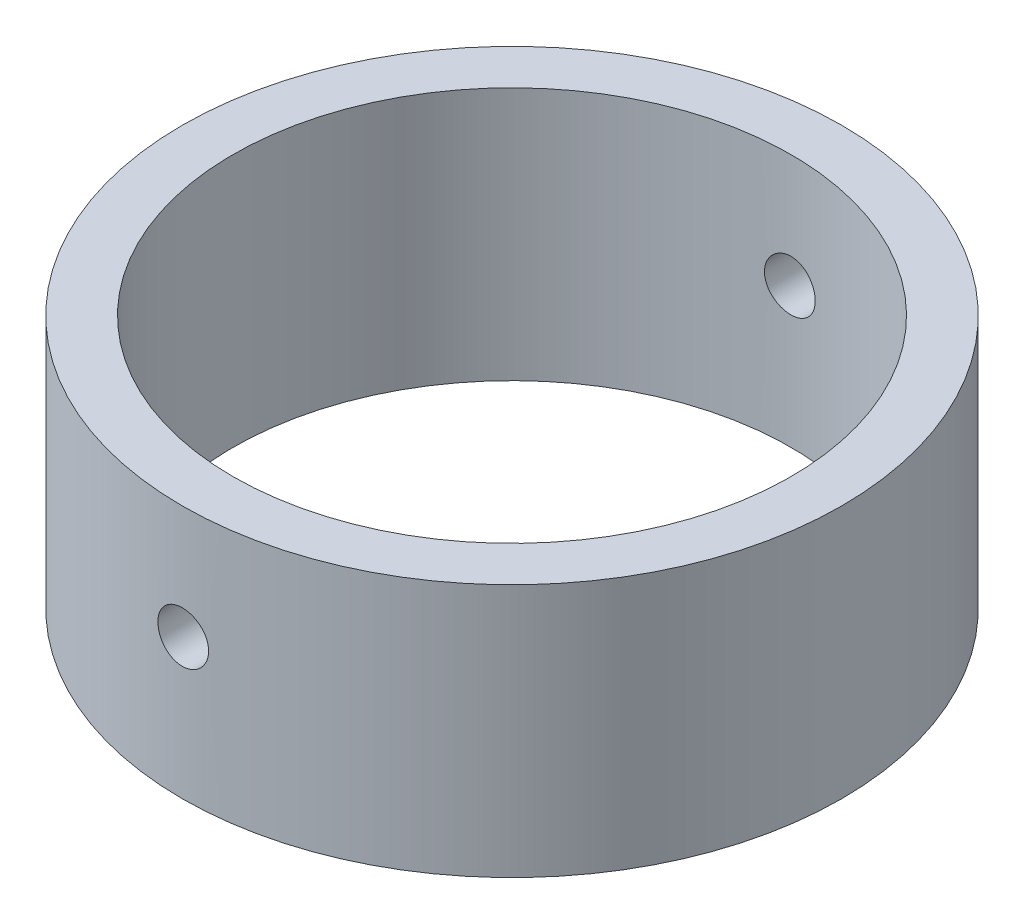
ISO-10303-21;
HEADER;
FILE_DESCRIPTION(('STEP AP214'),'2;1');
FILE_NAME('part.step','',(''),(''),'','','');
FILE_SCHEMA(('AUTOMOTIVE_DESIGN { 1 0 10303 214 1 1 1 1 }'));
ENDSEC;
DATA;
#1=APPLICATION_CONTEXT('core data for automotive mechanical design processes');
#2=APPLICATION_PROTOCOL_DEFINITION('international standard','automotive_design',2000,#1);
#3=PRODUCT_CONTEXT('',#1,'mechanical');
#4=PRODUCT('Part','Part','',(#3));
#5=PRODUCT_RELATED_PRODUCT_CATEGORY('part','',(#4));
#6=PRODUCT_DEFINITION_FORMATION('','',#4);
#7=PRODUCT_DEFINITION_CONTEXT('part definition',#1,'design');
#8=PRODUCT_DEFINITION('design','',#6,#7);
#9=PRODUCT_DEFINITION_SHAPE('','',#8);
#10=(LENGTH_UNIT() NAMED_UNIT(*) SI_UNIT(.MILLI.,.METRE.));
#11=(NAMED_UNIT(*) PLANE_ANGLE_UNIT() SI_UNIT($,.RADIAN.));
#12=(NAMED_UNIT(*) SI_UNIT($,.STERADIAN.) SOLID_ANGLE_UNIT());
#13=UNCERTAINTY_MEASURE_WITH_UNIT(LENGTH_MEASURE(1.E-05),#10,'distance_accuracy_value','');
#14=(GEOMETRIC_REPRESENTATION_CONTEXT(3) GLOBAL_UNCERTAINTY_ASSIGNED_CONTEXT((#13)) GLOBAL_UNIT_ASSIGNED_CONTEXT((#10,
#11,#12)) REPRESENTATION_CONTEXT('',''));
#15=CARTESIAN_POINT('',(0.,0.,0.));
#16=DIRECTION('',(0.,0.,1.));
#17=DIRECTION('',(1.,0.,0.));
#18=AXIS2_PLACEMENT_3D('',#15,#16,#17);
#19=CARTESIAN_POINT('',(0.,10.,0.));
#20=DIRECTION('',(0.,1.,0.));
#21=DIRECTION('',(0.,0.,1.));
#22=AXIS2_PLACEMENT_3D('',#19,#20,#21);
#23=PLANE('',#22);
#24=CARTESIAN_POINT('',(0.,10.,0.));
#25=DIRECTION('',(0.,1.,0.));
#26=DIRECTION('',(0.,0.,1.));
#27=AXIS2_PLACEMENT_3D('',#24,#25,#26);
#28=CIRCLE('',#27,13.);
#29=CARTESIAN_POINT('',(0.,10.,13.));
#30=VERTEX_POINT('',#29);
#31=EDGE_CURVE('E10',#30,#30,#28,.T.);
#32=ORIENTED_EDGE('',*,*,#31,.T.);
#33=EDGE_LOOP('',(#32));
#34=FACE_BOUND('',#33,.T.);
#35=CARTESIAN_POINT('',(0.,10.,0.));
#36=DIRECTION('',(0.,1.,0.));
#37=DIRECTION('',(0.,0.,1.));
#38=AXIS2_PLACEMENT_3D('',#35,#36,#37);
#39=CIRCLE('',#38,11.);
#40=CARTESIAN_POINT('',(0.,10.,11.));
#41=VERTEX_POINT('',#40);
#42=EDGE_CURVE('E51',#41,#41,#39,.T.);
#43=ORIENTED_EDGE('',*,*,#42,.F.);
#44=EDGE_LOOP('',(#43));
#45=FACE_BOUND('',#44,.T.);
#46=ADVANCED_FACE('F33',(#34,#45),#23,.T.);
#47=CARTESIAN_POINT('',(0.,0.,0.));
#48=DIRECTION('',(0.,1.,0.));
#49=DIRECTION('',(0.,0.,1.));
#50=AXIS2_PLACEMENT_3D('',#47,#48,#49);
#51=PLANE('',#50);
#52=CARTESIAN_POINT('',(0.,0.,0.));
#53=DIRECTION('',(0.,1.,0.));
#54=DIRECTION('',(0.,0.,1.));
#55=AXIS2_PLACEMENT_3D('',#52,#53,#54);
#56=CIRCLE('',#55,13.);
#57=CARTESIAN_POINT('',(0.,0.,13.));
#58=VERTEX_POINT('',#57);
#59=EDGE_CURVE('E46',#58,#58,#56,.T.);
#60=ORIENTED_EDGE('',*,*,#59,.F.);
#61=EDGE_LOOP('',(#60));
#62=FACE_BOUND('',#61,.T.);
#63=CARTESIAN_POINT('',(0.,0.,0.));
#64=DIRECTION('',(0.,1.,0.));
#65=DIRECTION('',(0.,0.,1.));
#66=AXIS2_PLACEMENT_3D('',#63,#64,#65);
#67=CIRCLE('',#66,11.);
#68=CARTESIAN_POINT('',(0.,0.,11.));
#69=VERTEX_POINT('',#68);
#70=EDGE_CURVE('E54',#69,#69,#67,.T.);
#71=ORIENTED_EDGE('',*,*,#70,.T.);
#72=EDGE_LOOP('',(#71));
#73=FACE_BOUND('',#72,.T.);
#74=ADVANCED_FACE('F87',(#62,#73),#51,.F.);
#75=CARTESIAN_POINT('',(0.,10.,0.));
#76=DIRECTION('',(0.,-1.,0.));
#77=DIRECTION('',(0.,0.,-1.));
#78=AXIS2_PLACEMENT_3D('',#75,#76,#77);
#79=CYLINDRICAL_SURFACE('',#78,13.);
#80=CARTESIAN_POINT('',(0.,4.52304622119221,13.0000000000001));
#81=CARTESIAN_POINT('',(-0.0560814907697586,4.52304867710966,12.999999493553));
#82=CARTESIAN_POINT('',(-0.112201528326009,4.52777978521671,12.9996332271085));
#83=CARTESIAN_POINT('',(-0.222889932280977,4.54658404380887,12.9982073319335));
#84=CARTESIAN_POINT('',(-0.277456450000618,4.56066787607049,12.9971469104259));
#85=CARTESIAN_POINT('',(-0.383418608244784,4.59776883504507,12.994452581674));
#86=CARTESIAN_POINT('',(-0.43481598379027,4.62078102248087,12.9928189915613));
#87=CARTESIAN_POINT('',(-0.533005853178158,4.67507689510917,12.9891617044986));
#88=CARTESIAN_POINT('',(-0.579799352410834,4.70635876884919,12.9871380930081));
#89=CARTESIAN_POINT('',(-0.667568517957818,4.77638041622868,12.9829230046583));
#90=CARTESIAN_POINT('',(-0.708532705181834,4.81513456049453,12.9807312093193));
#91=CARTESIAN_POINT('',(-0.783382016525469,4.89897047085162,12.9764294687494));
#92=CARTESIAN_POINT('',(-0.817266834917142,4.94405251007732,12.9743195270567));
#93=CARTESIAN_POINT('',(-0.877033518121978,5.03933286153711,12.9704168624999));
#94=CARTESIAN_POINT('',(-0.902905435846502,5.08953743088576,12.968624535088));
#95=CARTESIAN_POINT('',(-0.945848345562855,5.19359403233434,12.9655635081004));
#96=CARTESIAN_POINT('',(-0.962919472356537,5.24744600855258,12.9642948005044));
#97=CARTESIAN_POINT('',(-0.987743279956076,5.35715482646173,12.9624272217792));
#98=CARTESIAN_POINT('',(-0.995514486774616,5.41300745323639,12.9618270191131));
#99=CARTESIAN_POINT('',(-1.0015750773356,5.52522733793929,12.9613601552789));
#100=CARTESIAN_POINT('',(-0.999864615135208,5.58159458749115,12.9614934821925));
#101=CARTESIAN_POINT('',(-0.987025750384059,5.69311694724847,12.9624774073116));
#102=CARTESIAN_POINT('',(-0.975917451791061,5.7482743872884,12.9633264743837));
#103=CARTESIAN_POINT('',(-0.944629454899582,5.85593952861375,12.9656438018103));
#104=CARTESIAN_POINT('',(-0.924449679526362,5.90844720738156,12.9671120674258));
#105=CARTESIAN_POINT('',(-0.875568942970037,6.00938657411808,12.97050410972));
#106=CARTESIAN_POINT('',(-0.846858928239316,6.0578138609228,12.972428369926));
#107=CARTESIAN_POINT('',(-0.781739221271106,6.14916964758911,12.9765151166631));
#108=CARTESIAN_POINT('',(-0.745329396516499,6.19209805279209,12.978677607294));
#109=CARTESIAN_POINT('',(-0.665730694225889,6.27135441486226,12.9830039524831));
#110=CARTESIAN_POINT('',(-0.622524430401277,6.30766491324154,12.9851677959587));
#111=CARTESIAN_POINT('',(-0.530620071474907,6.37251986367981,12.9892476500003));
#112=CARTESIAN_POINT('',(-0.481921973376124,6.40106431150065,12.991163660431));
#113=CARTESIAN_POINT('',(-0.380405213011407,6.44957567074714,12.9945322475704));
#114=CARTESIAN_POINT('',(-0.327586197931921,6.46954184678716,12.9959847845445));
#115=CARTESIAN_POINT('',(-0.219331986593414,6.50031786308048,12.9982622809101));
#116=CARTESIAN_POINT('',(-0.163896836613344,6.51112786524078,12.9990872513988));
#117=CARTESIAN_POINT('',(-0.0521353319358138,6.52326287532752,13.0000152355339));
#118=CARTESIAN_POINT('',(0.00418838895988627,6.52461200582334,13.0001200852723));
#119=CARTESIAN_POINT('',(0.116261248401383,6.51785011296377,12.9996009110167));
#120=CARTESIAN_POINT('',(0.172010391499771,6.50973916462226,12.9989768928024));
#121=CARTESIAN_POINT('',(0.281283080875162,6.48430734094807,12.9970713651132));
#122=CARTESIAN_POINT('',(0.334809235536321,6.46699760841046,12.9957906511816));
#123=CARTESIAN_POINT('',(0.438197238207847,6.42367093474965,12.9927156735826));
#124=CARTESIAN_POINT('',(0.488059036618175,6.39765387579215,12.9909214029654));
#125=CARTESIAN_POINT('',(0.582812945330173,6.33759019121449,12.987016029033));
#126=CARTESIAN_POINT('',(0.627694871276151,6.30352754072549,12.9849042965023));
#127=CARTESIAN_POINT('',(0.711112292590212,6.22836279436949,12.9806035048102));
#128=CARTESIAN_POINT('',(0.749647693943661,6.18726059424007,12.9784144445039));
#129=CARTESIAN_POINT('',(0.819360586100733,6.09907901336334,12.974200318524));
#130=CARTESIAN_POINT('',(0.850522366332337,6.05198719309321,12.9721756089433));
#131=CARTESIAN_POINT('',(0.904495815325878,5.95322525327981,12.9685242888167));
#132=CARTESIAN_POINT('',(0.927307556813144,5.90155517361614,12.9668976748036));
#133=CARTESIAN_POINT('',(0.963906473397152,5.79515965980429,12.9642285924288));
#134=CARTESIAN_POINT('',(0.97770335706181,5.74043758169997,12.9631854958217));
#135=CARTESIAN_POINT('',(0.995912558294259,5.62944525377494,12.9617993686693));
#136=CARTESIAN_POINT('',(1.00032502648963,5.57317502881794,12.9614563268874));
#137=CARTESIAN_POINT('',(0.999638511579595,5.460839857113,12.9615092798327));
#138=CARTESIAN_POINT('',(0.994564216946278,5.40477475692293,12.9619033562753));
#139=CARTESIAN_POINT('',(0.975099599309404,5.29429542258207,12.9633820704167));
#140=CARTESIAN_POINT('',(0.96070926107664,5.23988119113017,12.9644667092444));
#141=CARTESIAN_POINT('',(0.923027087120274,5.1342459467331,12.967203837997));
#142=CARTESIAN_POINT('',(0.899735591367395,5.08302481191774,12.968856306234));
#143=CARTESIAN_POINT('',(0.844915171953942,4.98521604968228,12.9725429181572));
#144=CARTESIAN_POINT('',(0.813386405862039,4.93862833365422,12.9745770545423));
#145=CARTESIAN_POINT('',(0.742893897823909,4.85128273799166,12.9788040663569));
#146=CARTESIAN_POINT('',(0.70391196641198,4.81053955679034,12.9809973218178));
#147=CARTESIAN_POINT('',(0.619650805552294,4.73615914523524,12.9852920085213));
#148=CARTESIAN_POINT('',(0.574370049103664,4.70252364296569,12.9873934173351));
#149=CARTESIAN_POINT('',(0.478721573484242,4.64327528144806,12.9912708677167));
#150=CARTESIAN_POINT('',(0.428345598441459,4.61767572751272,12.9930463676726));
#151=CARTESIAN_POINT('',(0.324031895419177,4.57533060816491,12.9960653549984));
#152=CARTESIAN_POINT('',(0.270098369538004,4.55857480016781,12.9973094574985));
#153=CARTESIAN_POINT('',(0.179868830247617,4.53868989438482,12.9988038385362));
#154=CARTESIAN_POINT('',(0.144154148453396,4.53283124220409,12.9992503735318));
#155=CARTESIAN_POINT('',(0.0722983180736031,4.52500861820426,12.9998486171984));
#156=CARTESIAN_POINT('',(0.0361571704283412,4.52304463779946,13.0000003265194));
#157=CARTESIAN_POINT('',(0.,4.52304622119221,13.0000000000001));
#158=B_SPLINE_CURVE_WITH_KNOTS('',3,(#80,#81,#82,#83,#84,#85,#86,#87,#88,#89,#90,#91,#92,#93,
#94,#95,#96,#97,#98,#99,#100,#101,#102,#103,#104,#105,#106,#107,#108,#109,#110,#111,#112,#113,
#114,#115,#116,#117,#118,#119,#120,#121,#122,#123,#124,#125,#126,#127,#128,#129,#130,#131,#132,
#133,#134,#135,#136,#137,#138,#139,#140,#141,#142,#143,#144,#145,#146,#147,#148,#149,#150,#151,
#152,#153,#154,#155,#156,#157),.UNSPECIFIED.,.T.,.F.,(4,2,2,2,2,2,2,2,2,2,2,2,2,2,2,2,2,2,2,2,2,
2,2,2,2,2,2,2,2,2,2,2,2,2,2,2,2,2,4),(0.,0.168112465315285,0.336417263394327,0.504629085620898,
0.672804091988173,0.841305817090077,1.00981481756412,1.17853217168541,1.34724694148353,
1.51562505862669,1.68400043998793,1.85201653894625,2.02003406546067,2.18823055785305,
2.35642994521671,2.52506682664289,2.69370380009873,2.86235522733704,3.03100367227987,
3.19922195412499,3.36743890208862,3.53545254615546,3.70346846400482,3.87182189353086,
4.04017781674659,4.20888928027391,4.37759927436033,4.54612727511618,4.71465257083876,
4.88273990456448,5.05082751306817,5.21890870227693,5.38698667653834,5.55548020584205,
5.72401465382749,5.89282669420573,6.06144278967872,6.16982943161644,6.27821583461816),.UNSPECIFIED.);
#159=CARTESIAN_POINT('',(0.,4.52304622119221,13.0000000000001));
#160=VERTEX_POINT('',#159);
#161=EDGE_CURVE('E73',#160,#160,#158,.T.);
#162=ORIENTED_EDGE('',*,*,#161,.T.);
#163=EDGE_LOOP('',(#162));
#164=FACE_BOUND('',#163,.T.);
#165=CARTESIAN_POINT('',(0.,6.52304622119221,-13.));
#166=CARTESIAN_POINT('',(-0.0560814907698499,6.52304376527476,-12.9999994935529));
#167=CARTESIAN_POINT('',(-0.112201528326102,6.51831265716772,-12.9996332271085));
#168=CARTESIAN_POINT('',(-0.222889932281071,6.49950839857557,-12.9982073319335));
#169=CARTESIAN_POINT('',(-0.277456450000713,6.48542456631394,-12.997146910426));
#170=CARTESIAN_POINT('',(-0.383418608244882,6.44832360733937,-12.994452581674));
#171=CARTESIAN_POINT('',(-0.434815983790371,6.42531141990358,-12.9928189915613));
#172=CARTESIAN_POINT('',(-0.533005853178264,6.37101554727529,-12.9891617044986));
#173=CARTESIAN_POINT('',(-0.579799352410943,6.33973367353528,-12.9871380930081));
#174=CARTESIAN_POINT('',(-0.667568517957933,6.2697120261558,-12.9829230046582));
#175=CARTESIAN_POINT('',(-0.708532705181952,6.23095788188994,-12.9807312093192));
#176=CARTESIAN_POINT('',(-0.783382016525595,6.14712197153286,-12.9764294687494));
#177=CARTESIAN_POINT('',(-0.817266834917271,6.10203993230716,-12.9743195270567));
#178=CARTESIAN_POINT('',(-0.877033518122117,6.00675958084738,-12.9704168624999));
#179=CARTESIAN_POINT('',(-0.902905435846645,5.95655501149873,-12.968624535088));
#180=CARTESIAN_POINT('',(-0.945848345563006,5.85249841005016,-12.9655635081004));
#181=CARTESIAN_POINT('',(-0.962919472356694,5.79864643383192,-12.9642948005044));
#182=CARTESIAN_POINT('',(-0.987743279956243,5.68893761592277,-12.9624272217792));
#183=CARTESIAN_POINT('',(-0.995514486774788,5.63308498914811,-12.9618270191131));
#184=CARTESIAN_POINT('',(-1.00157507733578,5.52086510444521,-12.9613601552788));
#185=CARTESIAN_POINT('',(-0.999864615135394,5.46449785489336,-12.9614934821925));
#186=CARTESIAN_POINT('',(-0.987025750384255,5.35297549513604,-12.9624774073116));
#187=CARTESIAN_POINT('',(-0.975917451791262,5.2978180550961,-12.9633264743837));
#188=CARTESIAN_POINT('',(-0.944629454899793,5.19015291377075,-12.9656438018103));
#189=CARTESIAN_POINT('',(-0.924449679526577,5.13764523500294,-12.9671120674258));
#190=CARTESIAN_POINT('',(-0.875568942970261,5.03670586826641,-12.97050410972));
#191=CARTESIAN_POINT('',(-0.846858928239544,4.98827858146169,-12.9724283699259));
#192=CARTESIAN_POINT('',(-0.781739221271344,4.89692279479538,-12.9765151166631));
#193=CARTESIAN_POINT('',(-0.74532939651674,4.85399438959239,-12.978677607294));
#194=CARTESIAN_POINT('',(-0.665730694226137,4.77473802752221,-12.9830039524831));
#195=CARTESIAN_POINT('',(-0.622524430401528,4.73842752914293,-12.9851677959587));
#196=CARTESIAN_POINT('',(-0.530620071475165,4.67357257870465,-12.9892476500003));
#197=CARTESIAN_POINT('',(-0.481921973376385,4.6450281308838,-12.991163660431));
#198=CARTESIAN_POINT('',(-0.380405213011672,4.59651677163731,-12.9945322475704));
#199=CARTESIAN_POINT('',(-0.327586197932186,4.57655059559729,-12.9959847845445));
#200=CARTESIAN_POINT('',(-0.219331986593683,4.54577457930395,-12.9982622809101));
#201=CARTESIAN_POINT('',(-0.163896836613613,4.53496457714365,-12.9990872513988));
#202=CARTESIAN_POINT('',(-0.0521353319360836,4.5228295670569,-13.0000152355339));
#203=CARTESIAN_POINT('',(0.00418838895961608,4.52148043656107,-13.0001200852723));
#204=CARTESIAN_POINT('',(0.116261248401113,4.52824232942064,-12.9996009110167));
#205=CARTESIAN_POINT('',(0.172010391499502,4.53635327776213,-12.9989768928024));
#206=CARTESIAN_POINT('',(0.281283080874896,4.56178510143632,-12.9970713651132));
#207=CARTESIAN_POINT('',(0.334809235536056,4.57909483397392,-12.9957906511816));
#208=CARTESIAN_POINT('',(0.438197238207586,4.62242150763473,-12.9927156735826));
#209=CARTESIAN_POINT('',(0.488059036617916,4.64843856659222,-12.9909214029654));
#210=CARTESIAN_POINT('',(0.582812945329919,4.70850225116987,-12.987016029033));
#211=CARTESIAN_POINT('',(0.6276948712759,4.74256490165887,-12.9849042965023));
#212=CARTESIAN_POINT('',(0.711112292589968,4.81772964801486,-12.9806035048102));
#213=CARTESIAN_POINT('',(0.749647693943421,4.85883184814427,-12.9784144445039));
#214=CARTESIAN_POINT('',(0.819360586100501,4.947013429021,-12.974200318524));
#215=CARTESIAN_POINT('',(0.850522366332108,4.99410524929113,-12.9721756089433));
#216=CARTESIAN_POINT('',(0.904495815325658,5.09286718910452,-12.9685242888167));
#217=CARTESIAN_POINT('',(0.927307556812929,5.14453726876819,-12.9668976748036));
#218=CARTESIAN_POINT('',(0.963906473396946,5.25093278258004,-12.9642285924288));
#219=CARTESIAN_POINT('',(0.97770335706161,5.30565486068436,-12.9631854958217));
#220=CARTESIAN_POINT('',(0.995912558294068,5.41664718860939,-12.9617993686693));
#221=CARTESIAN_POINT('',(1.00032502648944,5.47291741356639,-12.9614563268874));
#222=CARTESIAN_POINT('',(0.99963851157942,5.58525258527132,-12.9615092798327));
#223=CARTESIAN_POINT('',(0.994564216946107,5.6413176854614,-12.9619033562753));
#224=CARTESIAN_POINT('',(0.975099599309244,5.75179701980225,-12.9633820704167));
#225=CARTESIAN_POINT('',(0.960709261076484,5.80621125125416,-12.9644667092444));
#226=CARTESIAN_POINT('',(0.923027087120128,5.91184649565123,-12.967203837997));
#227=CARTESIAN_POINT('',(0.899735591367252,5.96306763046659,-12.968856306234));
#228=CARTESIAN_POINT('',(0.844915171953808,6.06087639270206,-12.9725429181572));
#229=CARTESIAN_POINT('',(0.81338640586191,6.10746410873012,-12.9745770545423));
#230=CARTESIAN_POINT('',(0.742893897823788,6.19480970439268,-12.9788040663569));
#231=CARTESIAN_POINT('',(0.703911966411863,6.23555288559401,-12.9809973218178));
#232=CARTESIAN_POINT('',(0.619650805552184,6.30993329714912,-12.9852920085213));
#233=CARTESIAN_POINT('',(0.574370049103556,6.34356879941867,-12.9873934173351));
#234=CARTESIAN_POINT('',(0.478721573484138,6.40281716093632,-12.9912708677167));
#235=CARTESIAN_POINT('',(0.428345598441358,6.42841671487166,-12.9930463676726));
#236=CARTESIAN_POINT('',(0.324031895419079,6.47076183421947,-12.9960653549984));
#237=CARTESIAN_POINT('',(0.270098369537908,6.48751764221658,-12.9973094574984));
#238=CARTESIAN_POINT('',(0.179868830247523,6.50740254799958,-12.9988038385362));
#239=CARTESIAN_POINT('',(0.144154148453303,6.51326120018031,-12.9992503735318));
#240=CARTESIAN_POINT('',(0.0722983180735117,6.52108382418015,-12.9998486171984));
#241=CARTESIAN_POINT('',(0.0361571704282503,6.52304780458495,-13.0000003265194));
#242=CARTESIAN_POINT('',(0.,6.52304622119221,-13.));
#243=B_SPLINE_CURVE_WITH_KNOTS('',3,(#165,#166,#167,#168,#169,#170,#171,#172,#173,#174,#175,
#176,#177,#178,#179,#180,#181,#182,#183,#184,#185,#186,#187,#188,#189,#190,#191,#192,#193,#194,
#195,#196,#197,#198,#199,#200,#201,#202,#203,#204,#205,#206,#207,#208,#209,#210,#211,#212,#213,
#214,#215,#216,#217,#218,#219,#220,#221,#222,#223,#224,#225,#226,#227,#228,#229,#230,#231,#232,
#233,#234,#235,#236,#237,#238,#239,#240,#241,#242),.UNSPECIFIED.,.T.,.F.,(4,2,2,2,2,2,2,2,2,2,2,
2,2,2,2,2,2,2,2,2,2,2,2,2,2,2,2,2,2,2,2,2,2,2,2,2,2,2,4),(0.,0.168112465315286,
0.336417263394327,0.504629085620899,0.672804091988174,0.841305817090079,1.00981481756412,
1.17853217168542,1.34724694148354,1.51562505862669,1.68400043998793,1.85201653894625,
2.02003406546067,2.18823055785305,2.35642994521671,2.52506682664289,2.69370380009873,
2.86235522733704,3.03100367227987,3.19922195412499,3.36743890208862,3.53545254615546,
3.70346846400482,3.87182189353086,4.04017781674659,4.20888928027391,4.37759927436033,
4.54612727511618,4.71465257083876,4.88273990456448,5.05082751306817,5.21890870227693,
5.38698667653834,5.55548020584205,5.72401465382749,5.89282669420573,6.06144278967872,
6.16982943161643,6.27821583461815),.UNSPECIFIED.);
#244=CARTESIAN_POINT('',(0.,6.52304622119221,-13.));
#245=VERTEX_POINT('',#244);
#246=EDGE_CURVE('E77',#245,#245,#243,.T.);
#247=ORIENTED_EDGE('',*,*,#246,.T.);
#248=EDGE_LOOP('',(#247));
#249=FACE_BOUND('',#248,.T.);
#250=ORIENTED_EDGE('',*,*,#31,.F.);
#251=EDGE_LOOP('',(#250));
#252=FACE_BOUND('',#251,.T.);
#253=ORIENTED_EDGE('',*,*,#59,.T.);
#254=EDGE_LOOP('',(#253));
#255=FACE_BOUND('',#254,.T.);
#256=ADVANCED_FACE('F35',(#164,#249,#252,#255),#79,.T.);
#257=CARTESIAN_POINT('',(0.,10.,0.));
#258=DIRECTION('',(0.,-1.,0.));
#259=DIRECTION('',(0.,0.,-1.));
#260=AXIS2_PLACEMENT_3D('',#257,#258,#259);
#261=CYLINDRICAL_SURFACE('',#260,11.);
#262=CARTESIAN_POINT('',(0.,6.52304622119221,-11.));
#263=CARTESIAN_POINT('',(-0.0560463184098414,6.52304378193167,-10.9999994084562));
#264=CARTESIAN_POINT('',(-0.112130316304954,6.51831858102928,-10.9995670959793));
#265=CARTESIAN_POINT('',(-0.222745225910006,6.4995391573579,-10.9978840834393));
#266=CARTESIAN_POINT('',(-0.277274327670015,6.4854744912255,-10.9966324672553));
#267=CARTESIAN_POINT('',(-0.383161485731525,6.44842740629458,-10.9934522196378));
#268=CARTESIAN_POINT('',(-0.434521368502921,6.42545018064348,-10.9915239825183));
#269=CARTESIAN_POINT('',(-0.53264359406506,6.37123985543978,-10.987206461568));
#270=CARTESIAN_POINT('',(-0.57940688756065,6.34000846803171,-10.9848172733792));
#271=CARTESIAN_POINT('',(-0.667160744591656,6.27007539370033,-10.9798377243701));
#272=CARTESIAN_POINT('',(-0.70813558418098,6.23135401114806,-10.9772468441588));
#273=CARTESIAN_POINT('',(-0.783014385273141,6.14758192115207,-10.97216024971));
#274=CARTESIAN_POINT('',(-0.816918029190474,6.10253092958141,-10.969664539751));
#275=CARTESIAN_POINT('',(-0.876746442765615,6.00728171358463,-10.9650454120851));
#276=CARTESIAN_POINT('',(-0.902657198623758,5.95707465216723,-10.9629226510361));
#277=CARTESIAN_POINT('',(-0.945674826570917,5.85299993964666,-10.9592959576819));
#278=CARTESIAN_POINT('',(-0.962781880853229,5.79913236432422,-10.9577920125704));
#279=CARTESIAN_POINT('',(-0.987660408754465,5.68942465235792,-10.9555777617685));
#280=CARTESIAN_POINT('',(-0.995457725299644,5.63359042120906,-10.9548652594952));
#281=CARTESIAN_POINT('',(-1.00157529840905,5.52140152633064,-10.9543076849163));
#282=CARTESIAN_POINT('',(-0.999895763568809,5.46504687408336,-10.9544625935181));
#283=CARTESIAN_POINT('',(-0.987128641978366,5.35359438849497,-10.9556203369129));
#284=CARTESIAN_POINT('',(-0.976069197492892,5.29849330135754,-10.9566206352764));
#285=CARTESIAN_POINT('',(-0.944899944512281,5.19093267404066,-10.9593524793284));
#286=CARTESIAN_POINT('',(-0.924790032934574,5.13847316395569,-10.9610840333458));
#287=CARTESIAN_POINT('',(-0.876059375700773,5.03759547733084,-10.9650862067995));
#288=CARTESIAN_POINT('',(-0.84742606460213,4.98918340355426,-10.9673576211101));
#289=CARTESIAN_POINT('',(-0.782470448071408,4.89784158696078,-10.9721828791055));
#290=CARTESIAN_POINT('',(-0.746147956926813,4.85491197659895,-10.9747367296113));
#291=CARTESIAN_POINT('',(-0.666687485900027,4.77559011107148,-10.9798503993895));
#292=CARTESIAN_POINT('',(-0.623525187461616,4.7392222117241,-10.9824102065673));
#293=CARTESIAN_POINT('',(-0.531694989703026,4.67424463295821,-10.9872385467403));
#294=CARTESIAN_POINT('',(-0.483027085716893,4.6456349601148,-10.9895070794885));
#295=CARTESIAN_POINT('',(-0.381550897426026,4.59698724101439,-10.993497831358));
#296=CARTESIAN_POINT('',(-0.328742060406947,4.57695034132744,-10.9952199773945));
#297=CARTESIAN_POINT('',(-0.220490619126711,4.54603433919303,-10.9979231236776));
#298=CARTESIAN_POINT('',(-0.165048079965553,4.53515501051251,-10.9989041422334));
#299=CARTESIAN_POINT('',(-0.0533140741785202,4.52289366743432,-11.0000121495707));
#300=CARTESIAN_POINT('',(0.00297367354044308,4.5214780254136,-11.0001421622246));
#301=CARTESIAN_POINT('',(0.114985663809515,4.52809604872745,-10.9995415990194));
#302=CARTESIAN_POINT('',(0.170709912624621,4.53612960888877,-10.9988110327388));
#303=CARTESIAN_POINT('',(0.279916706707193,4.56139011003598,-10.9965733842767));
#304=CARTESIAN_POINT('',(0.333402902587821,4.57860139564183,-10.995067624572));
#305=CARTESIAN_POINT('',(0.436728566317746,4.62171275003228,-10.9914486415711));
#306=CARTESIAN_POINT('',(0.486567965967316,4.64761298126065,-10.9893354069179));
#307=CARTESIAN_POINT('',(0.581337885149216,4.70745104104731,-10.9847306057481));
#308=CARTESIAN_POINT('',(0.626254337365141,4.74141106791383,-10.9822380012953));
#309=CARTESIAN_POINT('',(0.709761176719535,4.81637275522198,-10.977157767899));
#310=CARTESIAN_POINT('',(0.748351432920192,4.8573745613764,-10.97457013699));
#311=CARTESIAN_POINT('',(0.818226404119228,4.94540219002745,-10.9695824762449));
#312=CARTESIAN_POINT('',(0.849489120333488,4.99244551220134,-10.9671830253566));
#313=CARTESIAN_POINT('',(0.903670571531669,5.09113402386894,-10.9628518833791));
#314=CARTESIAN_POINT('',(0.926589403284334,5.14277915998416,-10.960920186865));
#315=CARTESIAN_POINT('',(0.963395308748925,5.249128449654,-10.9577466928029));
#316=CARTESIAN_POINT('',(0.977295685719593,5.30382796759134,-10.9565038794692));
#317=CARTESIAN_POINT('',(0.995713351025628,5.41479639859508,-10.9548455848288));
#318=CARTESIAN_POINT('',(1.00023085779486,5.4710652750958,-10.9544300842624));
#319=CARTESIAN_POINT('',(0.999751807856416,5.58335652707081,-10.9544737983698));
#320=CARTESIAN_POINT('',(0.994789811978297,5.63937905444945,-10.9549298355514));
#321=CARTESIAN_POINT('',(0.975564848079225,5.74979138721387,-10.9566584801842));
#322=CARTESIAN_POINT('',(0.961301867354955,5.80418119036956,-10.9579310887508));
#323=CARTESIAN_POINT('',(0.923888910367273,5.90978529073349,-10.9611486303441));
#324=CARTESIAN_POINT('',(0.900739731146467,5.96099987226306,-10.9630935030709));
#325=CARTESIAN_POINT('',(0.846215209238869,6.05882170918496,-10.9674365507443));
#326=CARTESIAN_POINT('',(0.814839959616667,6.10542901669286,-10.9698347205624));
#327=CARTESIAN_POINT('',(0.744623983723067,6.19289034138713,-10.974824588714));
#328=CARTESIAN_POINT('',(0.705757574318428,6.23372370287132,-10.9774169335148));
#329=CARTESIAN_POINT('',(0.621711388303149,6.30830528671043,-10.9824971408049));
#330=CARTESIAN_POINT('',(0.576530093161667,6.34205180000281,-10.9849849779758));
#331=CARTESIAN_POINT('',(0.481033658224396,6.40155615969212,-10.9895812046646));
#332=CARTESIAN_POINT('',(0.430707731221003,6.42729674313287,-10.991688770164));
#333=CARTESIAN_POINT('',(0.326462314296744,6.46992873986516,-10.9952776769949));
#334=CARTESIAN_POINT('',(0.272547000575699,6.48683024126177,-10.9967597318513));
#335=CARTESIAN_POINT('',(0.181932564267665,6.50703863321429,-10.9985536427098));
#336=CARTESIAN_POINT('',(0.145814736978494,6.51303340410682,-10.9990935316791));
#337=CARTESIAN_POINT('',(0.0731366213756723,6.52103798753106,-10.9998169027657));
#338=CARTESIAN_POINT('',(0.0365763345072775,6.52304781307571,-11.0000003860468));
#339=CARTESIAN_POINT('',(0.,6.52304622119221,-11.));
#340=B_SPLINE_CURVE_WITH_KNOTS('',3,(#262,#263,#264,#265,#266,#267,#268,#269,#270,#271,#272,
#273,#274,#275,#276,#277,#278,#279,#280,#281,#282,#283,#284,#285,#286,#287,#288,#289,#290,#291,
#292,#293,#294,#295,#296,#297,#298,#299,#300,#301,#302,#303,#304,#305,#306,#307,#308,#309,#310,
#311,#312,#313,#314,#315,#316,#317,#318,#319,#320,#321,#322,#323,#324,#325,#326,#327,#328,#329,
#330,#331,#332,#333,#334,#335,#336,#337,#338,#339),.UNSPECIFIED.,.T.,.F.,(4,2,2,2,2,2,2,2,2,2,2,
2,2,2,2,2,2,2,2,2,2,2,2,2,2,2,2,2,2,2,2,2,2,2,2,2,2,2,4),(0.,0.168005403293994,
0.336198986814516,0.50429471458982,0.672355601927656,0.840864580762713,1.00938112613858,
1.17819147121128,1.34699832260011,1.51533548498079,1.68366894209663,1.85149913268034,
2.01933123485658,2.18741199578101,2.3554968167304,2.52419324668971,2.69288981961891,
2.86160894791215,3.03032390796419,3.19843904757525,3.36655231601789,3.5343797296295,
3.7022102810255,3.87050854855106,4.03881029902679,4.20761103289356,4.37640980902048,
4.54495901796127,4.71350430302094,4.88143627001253,5.04936846636666,5.21728560365455,
5.38520084131544,5.55370235279869,5.72224445351765,5.89114749675568,6.05985734676956,
6.16949955112993,6.27914139745025),.UNSPECIFIED.);
#341=CARTESIAN_POINT('',(0.,6.52304622119221,-11.));
#342=VERTEX_POINT('',#341);
#343=EDGE_CURVE('E38',#342,#342,#340,.T.);
#344=ORIENTED_EDGE('',*,*,#343,.F.);
#345=EDGE_LOOP('',(#344));
#346=FACE_BOUND('',#345,.T.);
#347=CARTESIAN_POINT('',(-0.999999999999924,5.52304622119221,10.9544511501033));
#348=CARTESIAN_POINT('',(-0.999997560254757,5.57909200001348,10.9544517508113));
#349=CARTESIAN_POINT('',(-0.99527244726098,5.63517546004857,10.954885899599));
#350=CARTESIAN_POINT('',(-0.976493404516612,5.74578925211086,10.9565754722183));
#351=CARTESIAN_POINT('',(-0.962429029544823,5.80031777376589,10.9578318155864));
#352=CARTESIAN_POINT('',(-0.925382796374784,5.90620370526713,10.9610223176075));
#353=CARTESIAN_POINT('',(-0.902406145177872,5.95756294649556,10.962956080414));
#354=CARTESIAN_POINT('',(-0.848197172713431,6.05568409742381,10.9672830433453));
#355=CARTESIAN_POINT('',(-0.81696656217696,6.10244695702613,10.9696761482379));
#356=CARTESIAN_POINT('',(-0.747034272072785,6.19020130527334,10.9746602823738));
#357=CARTESIAN_POINT('',(-0.708312723364518,6.23117693223809,10.9772518266651));
#358=CARTESIAN_POINT('',(-0.624539970629369,6.30605725261276,10.9823361407473));
#359=CARTESIAN_POINT('',(-0.579488484622105,6.33996163085178,10.9848289061316));
#360=CARTESIAN_POINT('',(-0.484238836673006,6.39979081131615,10.9894397775055));
#361=CARTESIAN_POINT('',(-0.434031922755664,6.42570173488298,10.9915572291746));
#362=CARTESIAN_POINT('',(-0.329957530859503,6.46871971359613,10.9951733171235));
#363=CARTESIAN_POINT('',(-0.276090127830746,6.48582694894024,10.9966719660691));
#364=CARTESIAN_POINT('',(-0.1663829382074,6.51070585665707,10.9988779842707));
#365=CARTESIAN_POINT('',(-0.11054906039508,6.5185033872902,10.9995875448885));
#366=CARTESIAN_POINT('',(0.00163914303917785,6.52462151099144,11.0001428768677));
#367=CARTESIAN_POINT('',(0.0579934573055637,6.52294231034961,10.9999886670317));
#368=CARTESIAN_POINT('',(0.169447419867372,6.51017571671515,10.9988356349174));
#369=CARTESIAN_POINT('',(0.224550282636079,6.49911612960637,10.9978393089187));
#370=CARTESIAN_POINT('',(0.332114387619726,6.46794597544621,10.9951169372367));
#371=CARTESIAN_POINT('',(0.384575600680039,6.44783530852671,10.9933908835017));
#372=CARTESIAN_POINT('',(0.48545534716957,6.39910308969276,10.9893988885857));
#373=CARTESIAN_POINT('',(0.533867863586994,6.37046914896638,10.9871321624821));
#374=CARTESIAN_POINT('',(0.625210298204722,6.3055121898971,10.9823133884739));
#375=CARTESIAN_POINT('',(0.668140083705778,6.26918898550649,10.9797613336663));
#376=CARTESIAN_POINT('',(0.747461139246654,6.18972801002282,10.974647636397));
#377=CARTESIAN_POINT('',(0.783828197606478,6.14656606562475,10.9720859926448));
#378=CARTESIAN_POINT('',(0.848804248472361,6.05473687533178,10.9672510825487));
#379=CARTESIAN_POINT('',(0.877413232674646,6.00606962354441,10.9649778165135));
#380=CARTESIAN_POINT('',(0.926060456943988,5.90459360882755,10.9609767271737));
#381=CARTESIAN_POINT('',(0.946097337230603,5.85178419040321,10.9592489904169));
#382=CARTESIAN_POINT('',(0.977013122262611,5.74353148582836,10.9565363289721));
#383=CARTESIAN_POINT('',(0.987892256749936,5.68808826578935,10.9555513856496));
#384=CARTESIAN_POINT('',(1.00015286782761,5.57635394820695,10.954438951586));
#385=CARTESIAN_POINT('',(1.00156815482271,5.52006658980643,10.9543084084628));
#386=CARTESIAN_POINT('',(0.994949560430652,5.40805546357567,10.9549115004788));
#387=CARTESIAN_POINT('',(0.986915784217734,5.35233168947931,10.9556451259993));
#388=CARTESIAN_POINT('',(0.961655343166113,5.24312723170931,10.9578911146059));
#389=CARTESIAN_POINT('',(0.944444546844662,5.18964284743625,10.9594021332984));
#390=CARTESIAN_POINT('',(0.90133477805932,5.08632059032401,10.9630315520312));
#391=CARTESIAN_POINT('',(0.875435640271465,5.03648278689489,10.9651499636291));
#392=CARTESIAN_POINT('',(0.815599185736805,4.94171394794585,10.9697628742462));
#393=CARTESIAN_POINT('',(0.781639392791759,4.89679715536933,10.9722584176541));
#394=CARTESIAN_POINT('',(0.706677976316805,4.8132895202554,10.9773409274578));
#395=CARTESIAN_POINT('',(0.665676208718468,4.77469880717184,10.9799278957231));
#396=CARTESIAN_POINT('',(0.577648379080161,4.70482285917711,10.9849109146188));
#397=CARTESIAN_POINT('',(0.530604810821243,4.67355963031774,10.9873063762702));
#398=CARTESIAN_POINT('',(0.431915671283464,4.61937727945362,10.9916279546446));
#399=CARTESIAN_POINT('',(0.380270153453627,4.59645806055368,10.9935540768178));
#400=CARTESIAN_POINT('',(0.27392111323966,4.55965189676086,10.9967172675743));
#401=CARTESIAN_POINT('',(0.219222284792813,4.54575148089368,10.9979553634324));
#402=CARTESIAN_POINT('',(0.108255307091551,4.52733350412489,10.9996071930653));
#403=CARTESIAN_POINT('',(0.0519871937858928,4.5228157284669,11.0000209457081));
#404=CARTESIAN_POINT('',(-0.060304528035226,4.52329399841131,10.9999774829522));
#405=CARTESIAN_POINT('',(-0.116328286752792,4.52825580682144,10.9995234018861));
#406=CARTESIAN_POINT('',(-0.226743128750788,4.54748082915022,10.9978014810173));
#407=CARTESIAN_POINT('',(-0.281134210184274,4.56174405359056,10.9965336402942));
#408=CARTESIAN_POINT('',(-0.38674085708822,4.59915797546174,10.9933263613998));
#409=CARTESIAN_POINT('',(-0.437956703518412,4.62230788524944,10.9913869827498));
#410=CARTESIAN_POINT('',(-0.535780765065283,4.67683425953783,10.9870532563506));
#411=CARTESIAN_POINT('',(-0.58238903308048,4.70821062957737,10.9846589138258));
#412=CARTESIAN_POINT('',(-0.669850290308648,4.77842783298684,10.9796734621922));
#413=CARTESIAN_POINT('',(-0.710682828578474,4.81729409357082,10.9770817015369));
#414=CARTESIAN_POINT('',(-0.785262821067126,4.90133964389227,10.9719990677238));
#415=CARTESIAN_POINT('',(-0.819008564073391,4.9465204539957,10.9695082190496));
#416=CARTESIAN_POINT('',(-0.878512100284467,5.04201649853804,10.964903640195));
#417=CARTESIAN_POINT('',(-0.904252490719291,5.09234260728769,10.9627907357997));
#418=CARTESIAN_POINT('',(-0.94688407617295,5.19658841069468,10.9591912326929));
#419=CARTESIAN_POINT('',(-0.963785361996662,5.25050392799887,10.9577039201814));
#420=CARTESIAN_POINT('',(-0.983993142840011,5.34111778689356,10.9559033088399));
#421=CARTESIAN_POINT('',(-0.989987638731548,5.37723478996474,10.9553612835582));
#422=CARTESIAN_POINT('',(-0.997991856799864,5.44991125407945,10.9546350087714));
#423=CARTESIAN_POINT('',(-1.00000159217902,5.48647071365664,10.9544507580809));
#424=CARTESIAN_POINT('',(-0.999999999999924,5.52304622119221,10.9544511501033));
#425=B_SPLINE_CURVE_WITH_KNOTS('',3,(#347,#348,#349,#350,#351,#352,#353,#354,#355,#356,#357,
#358,#359,#360,#361,#362,#363,#364,#365,#366,#367,#368,#369,#370,#371,#372,#373,#374,#375,#376,
#377,#378,#379,#380,#381,#382,#383,#384,#385,#386,#387,#388,#389,#390,#391,#392,#393,#394,#395,
#396,#397,#398,#399,#400,#401,#402,#403,#404,#405,#406,#407,#408,#409,#410,#411,#412,#413,#414,
#415,#416,#417,#418,#419,#420,#421,#422,#423,#424),.UNSPECIFIED.,.T.,.F.,(4,2,2,2,2,2,2,2,2,2,2,
2,2,2,2,2,2,2,2,2,2,2,2,2,2,2,2,2,2,2,2,2,2,2,2,2,2,2,4),(0.,0.168003782557652,
0.336195781161784,0.50428966117132,0.672348729013334,0.8408598286348,1.00937843731933,
1.17818801124541,1.34699412976499,1.51533028026027,1.68366276641801,1.85149800858578,
2.01933510266518,2.18741735383105,2.35550367234285,2.52419796477562,2.69289243776787,
2.86161366060712,3.03033065058212,3.1984445611421,3.36655660050244,3.53437888582246,
3.70220436468859,3.87050341961896,4.03880591811036,4.20760756864074,4.37640725889159,
4.54495423675486,4.71349735675538,4.8814329040551,5.04936864132251,5.21728949757475,
5.38520842574342,5.55370779261807,5.72224779951831,5.89115167368363,6.05986230235814,
6.16950203086981,6.27914139612045),.UNSPECIFIED.);
#426=CARTESIAN_POINT('',(-0.999999999999924,5.52304622119221,10.9544511501033));
#427=VERTEX_POINT('',#426);
#428=EDGE_CURVE('E56',#427,#427,#425,.T.);
#429=ORIENTED_EDGE('',*,*,#428,.F.);
#430=EDGE_LOOP('',(#429));
#431=FACE_BOUND('',#430,.T.);
#432=ORIENTED_EDGE('',*,*,#42,.T.);
#433=EDGE_LOOP('',(#432));
#434=FACE_BOUND('',#433,.T.);
#435=ORIENTED_EDGE('',*,*,#70,.F.);
#436=EDGE_LOOP('',(#435));
#437=FACE_BOUND('',#436,.T.);
#438=ADVANCED_FACE('F60',(#346,#431,#434,#437),#261,.F.);
#439=CARTESIAN_POINT('',(0.,5.52304622119221,13.0000000000001));
#440=DIRECTION('',(0.,0.,-1.));
#441=DIRECTION('',(-1.,0.,0.));
#442=AXIS2_PLACEMENT_3D('',#439,#440,#441);
#443=CYLINDRICAL_SURFACE('',#442,1.);
#444=ORIENTED_EDGE('',*,*,#428,.T.);
#445=EDGE_LOOP('',(#444));
#446=FACE_BOUND('',#445,.T.);
#447=ORIENTED_EDGE('',*,*,#161,.F.);
#448=EDGE_LOOP('',(#447));
#449=FACE_BOUND('',#448,.T.);
#450=ADVANCED_FACE('F66',(#446,#449),#443,.F.);
#451=ORIENTED_EDGE('',*,*,#343,.T.);
#452=EDGE_LOOP('',(#451));
#453=FACE_BOUND('',#452,.T.);
#454=ORIENTED_EDGE('',*,*,#246,.F.);
#455=EDGE_LOOP('',(#454));
#456=FACE_BOUND('',#455,.T.);
#457=ADVANCED_FACE('F63',(#453,#456),#443,.F.);
#458=CLOSED_SHELL('',(#46,#74,#256,#438,#450,#457));
#459=MANIFOLD_SOLID_BREP('B2',#458);
#460=ADVANCED_BREP_SHAPE_REPRESENTATION('',(#18,#459),#14);
#461=SHAPE_DEFINITION_REPRESENTATION(#9,#460);
ENDSEC;
END-ISO-10303-21;
